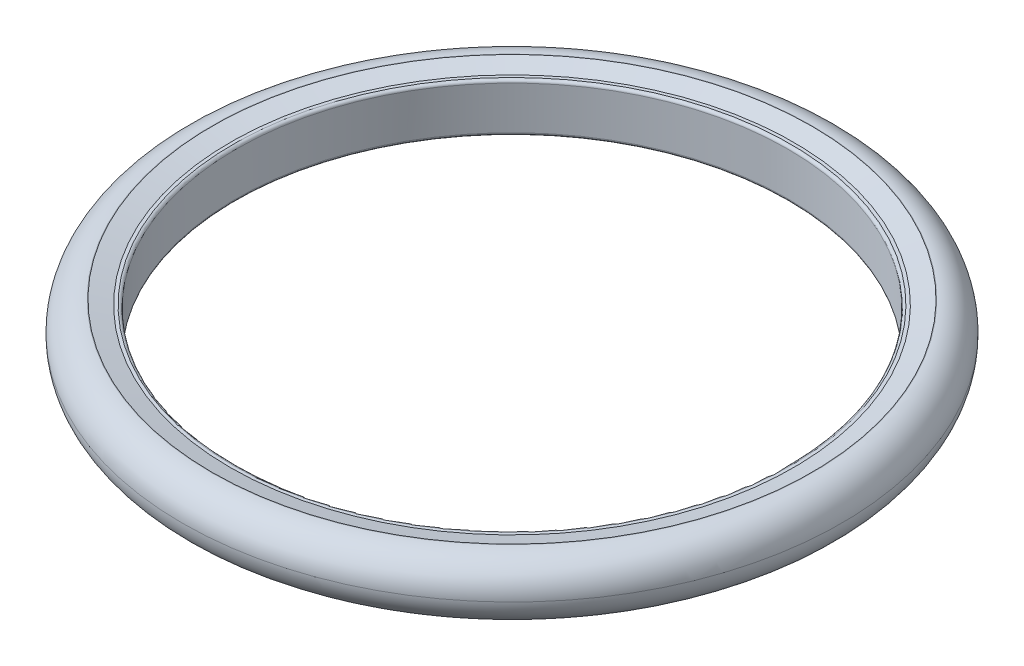
ISO-10303-21;
HEADER;
FILE_DESCRIPTION(('STEP AP214'),'2;1');
FILE_NAME('part.step','',(''),(''),'','','');
FILE_SCHEMA(('AUTOMOTIVE_DESIGN { 1 0 10303 214 1 1 1 1 }'));
ENDSEC;
DATA;
#1=APPLICATION_CONTEXT('core data for automotive mechanical design processes');
#2=APPLICATION_PROTOCOL_DEFINITION('international standard','automotive_design',2000,#1);
#3=PRODUCT_CONTEXT('',#1,'mechanical');
#4=PRODUCT('Part','Part','',(#3));
#5=PRODUCT_RELATED_PRODUCT_CATEGORY('part','',(#4));
#6=PRODUCT_DEFINITION_FORMATION('','',#4);
#7=PRODUCT_DEFINITION_CONTEXT('part definition',#1,'design');
#8=PRODUCT_DEFINITION('design','',#6,#7);
#9=PRODUCT_DEFINITION_SHAPE('','',#8);
#10=(LENGTH_UNIT() NAMED_UNIT(*) SI_UNIT(.MILLI.,.METRE.));
#11=(NAMED_UNIT(*) PLANE_ANGLE_UNIT() SI_UNIT($,.RADIAN.));
#12=(NAMED_UNIT(*) SI_UNIT($,.STERADIAN.) SOLID_ANGLE_UNIT());
#13=UNCERTAINTY_MEASURE_WITH_UNIT(LENGTH_MEASURE(1.E-05),#10,'distance_accuracy_value','');
#14=(GEOMETRIC_REPRESENTATION_CONTEXT(3) GLOBAL_UNCERTAINTY_ASSIGNED_CONTEXT((#13)) GLOBAL_UNIT_ASSIGNED_CONTEXT((#10,
#11,#12)) REPRESENTATION_CONTEXT('',''));
#15=CARTESIAN_POINT('',(0.,0.,0.));
#16=DIRECTION('',(0.,0.,1.));
#17=DIRECTION('',(1.,0.,0.));
#18=AXIS2_PLACEMENT_3D('',#15,#16,#17);
#19=CARTESIAN_POINT('',(0.,15.,0.));
#20=DIRECTION('',(0.,-1.,0.));
#21=DIRECTION('',(0.,0.,-1.));
#22=AXIS2_PLACEMENT_3D('',#19,#20,#21);
#23=CYLINDRICAL_SURFACE('',#22,170.);
#24=CARTESIAN_POINT('',(0.,13.25,0.));
#25=DIRECTION('',(0.,1.,0.));
#26=DIRECTION('',(0.,0.,1.));
#27=AXIS2_PLACEMENT_3D('',#24,#25,#26);
#28=CIRCLE('',#27,170.);
#29=CARTESIAN_POINT('',(0.,13.25,170.));
#30=VERTEX_POINT('',#29);
#31=EDGE_CURVE('E44',#30,#30,#28,.T.);
#32=ORIENTED_EDGE('',*,*,#31,.T.);
#33=EDGE_LOOP('',(#32));
#34=FACE_BOUND('',#33,.T.);
#35=CARTESIAN_POINT('',(0.,-13.25,0.));
#36=DIRECTION('',(0.,-1.,0.));
#37=DIRECTION('',(0.,0.,-1.));
#38=AXIS2_PLACEMENT_3D('',#35,#36,#37);
#39=CIRCLE('',#38,170.);
#40=CARTESIAN_POINT('',(0.,-13.25,-170.));
#41=VERTEX_POINT('',#40);
#42=EDGE_CURVE('E48',#41,#41,#39,.T.);
#43=ORIENTED_EDGE('',*,*,#42,.T.);
#44=EDGE_LOOP('',(#43));
#45=FACE_BOUND('',#44,.T.);
#46=ADVANCED_FACE('F33',(#34,#45),#23,.F.);
#47=CARTESIAN_POINT('',(0.,15.,0.));
#48=DIRECTION('',(0.,1.,0.));
#49=DIRECTION('',(0.,0.,1.));
#50=AXIS2_PLACEMENT_3D('',#47,#48,#49);
#51=PLANE('',#50);
#52=CARTESIAN_POINT('',(0.,15.,0.));
#53=DIRECTION('',(0.,1.,0.));
#54=DIRECTION('',(0.,0.,1.));
#55=AXIS2_PLACEMENT_3D('',#52,#53,#54);
#56=CIRCLE('',#55,171.75);
#57=CARTESIAN_POINT('',(0.,15.,171.75));
#58=VERTEX_POINT('',#57);
#59=EDGE_CURVE('E40',#58,#58,#56,.F.);
#60=ORIENTED_EDGE('',*,*,#59,.T.);
#61=EDGE_LOOP('',(#60));
#62=FACE_BOUND('',#61,.T.);
#63=CARTESIAN_POINT('',(0.,15.,0.));
#64=DIRECTION('',(0.,1.,0.));
#65=DIRECTION('',(0.,0.,1.));
#66=AXIS2_PLACEMENT_3D('',#63,#64,#65);
#67=CIRCLE('',#66,173.695873505534);
#68=CARTESIAN_POINT('',(0.,15.,173.695873505534));
#69=VERTEX_POINT('',#68);
#70=EDGE_CURVE('E69',#69,#69,#67,.T.);
#71=ORIENTED_EDGE('',*,*,#70,.T.);
#72=EDGE_LOOP('',(#71));
#73=FACE_BOUND('',#72,.T.);
#74=ADVANCED_FACE('F94',(#62,#73),#51,.T.);
#75=CARTESIAN_POINT('',(0.,18.,0.));
#76=DIRECTION('',(0.,1.,0.));
#77=DIRECTION('',(0.,0.,1.));
#78=AXIS2_PLACEMENT_3D('',#75,#76,#77);
#79=PLANE('',#78);
#80=CARTESIAN_POINT('',(0.,18.,0.));
#81=DIRECTION('',(0.,1.,0.));
#82=DIRECTION('',(0.,0.,1.));
#83=AXIS2_PLACEMENT_3D('',#80,#81,#82);
#84=CIRCLE('',#83,185.2);
#85=CARTESIAN_POINT('',(0.,18.,185.2));
#86=VERTEX_POINT('',#85);
#87=EDGE_CURVE('E60',#86,#86,#84,.T.);
#88=ORIENTED_EDGE('',*,*,#87,.T.);
#89=EDGE_LOOP('',(#88));
#90=FACE_BOUND('',#89,.T.);
#91=CARTESIAN_POINT('',(0.,18.,0.));
#92=DIRECTION('',(0.,1.,0.));
#93=DIRECTION('',(0.,0.,1.));
#94=AXIS2_PLACEMENT_3D('',#91,#92,#93);
#95=CIRCLE('',#94,184.89202592824);
#96=CARTESIAN_POINT('',(0.,18.,184.89202592824));
#97=VERTEX_POINT('',#96);
#98=EDGE_CURVE('E63',#97,#97,#95,.F.);
#99=ORIENTED_EDGE('',*,*,#98,.T.);
#100=EDGE_LOOP('',(#99));
#101=FACE_BOUND('',#100,.T.);
#102=ADVANCED_FACE('F91',(#90,#101),#79,.T.);
#103=CARTESIAN_POINT('',(0.,-15.,0.));
#104=DIRECTION('',(0.,-1.,0.));
#105=DIRECTION('',(0.,0.,1.));
#106=AXIS2_PLACEMENT_3D('',#103,#104,#105);
#107=PLANE('',#106);
#108=CARTESIAN_POINT('',(0.,-15.,0.));
#109=DIRECTION('',(0.,-1.,0.));
#110=DIRECTION('',(0.,0.,-1.));
#111=AXIS2_PLACEMENT_3D('',#108,#109,#110);
#112=CIRCLE('',#111,171.75);
#113=CARTESIAN_POINT('',(0.,-15.,-171.75));
#114=VERTEX_POINT('',#113);
#115=EDGE_CURVE('E10',#114,#114,#112,.F.);
#116=ORIENTED_EDGE('',*,*,#115,.T.);
#117=EDGE_LOOP('',(#116));
#118=FACE_BOUND('',#117,.T.);
#119=CARTESIAN_POINT('',(0.,-15.,0.));
#120=DIRECTION('',(0.,-1.,0.));
#121=DIRECTION('',(0.,0.,-1.));
#122=AXIS2_PLACEMENT_3D('',#119,#120,#121);
#123=CIRCLE('',#122,173.695873505534);
#124=CARTESIAN_POINT('',(0.,-15.,-173.695873505534));
#125=VERTEX_POINT('',#124);
#126=EDGE_CURVE('E57',#125,#125,#123,.T.);
#127=ORIENTED_EDGE('',*,*,#126,.T.);
#128=EDGE_LOOP('',(#127));
#129=FACE_BOUND('',#128,.T.);
#130=ADVANCED_FACE('F75',(#118,#129),#107,.T.);
#131=CARTESIAN_POINT('',(0.,-18.,0.));
#132=DIRECTION('',(0.,-1.,0.));
#133=DIRECTION('',(0.,0.,1.));
#134=AXIS2_PLACEMENT_3D('',#131,#132,#133);
#135=PLANE('',#134);
#136=CARTESIAN_POINT('',(0.,-18.,0.));
#137=DIRECTION('',(0.,-1.,0.));
#138=DIRECTION('',(0.,0.,-1.));
#139=AXIS2_PLACEMENT_3D('',#136,#137,#138);
#140=CIRCLE('',#139,185.2);
#141=CARTESIAN_POINT('',(0.,-18.,-185.2));
#142=VERTEX_POINT('',#141);
#143=EDGE_CURVE('E53',#142,#142,#140,.T.);
#144=ORIENTED_EDGE('',*,*,#143,.T.);
#145=EDGE_LOOP('',(#144));
#146=FACE_BOUND('',#145,.T.);
#147=CARTESIAN_POINT('',(0.,-18.,0.));
#148=DIRECTION('',(0.,-1.,0.));
#149=DIRECTION('',(0.,0.,-1.));
#150=AXIS2_PLACEMENT_3D('',#147,#148,#149);
#151=CIRCLE('',#150,184.89202592824);
#152=CARTESIAN_POINT('',(0.,-18.,-184.89202592824));
#153=VERTEX_POINT('',#152);
#154=EDGE_CURVE('E66',#153,#153,#151,.F.);
#155=ORIENTED_EDGE('',*,*,#154,.T.);
#156=EDGE_LOOP('',(#155));
#157=FACE_BOUND('',#156,.T.);
#158=ADVANCED_FACE('F81',(#146,#157),#135,.T.);
#159=CARTESIAN_POINT('',(0.,-19.019237886467,0.));
#160=DIRECTION('',(0.,-1.,0.));
#161=DIRECTION('',(0.,0.,-1.));
#162=AXIS2_PLACEMENT_3D('',#159,#160,#161);
#163=CONICAL_SURFACE('',#162,188.695873505534,1.30899693899574);
#164=ORIENTED_EDGE('',*,*,#126,.F.);
#165=EDGE_LOOP('',(#164));
#166=FACE_BOUND('',#165,.T.);
#167=ORIENTED_EDGE('',*,*,#154,.F.);
#168=EDGE_LOOP('',(#167));
#169=FACE_BOUND('',#168,.T.);
#170=ADVANCED_FACE('F77',(#166,#169),#163,.F.);
#171=CARTESIAN_POINT('',(0.,19.019237886467,0.));
#172=DIRECTION('',(0.,1.,0.));
#173=DIRECTION('',(0.,0.,1.));
#174=AXIS2_PLACEMENT_3D('',#171,#172,#173);
#175=CONICAL_SURFACE('',#174,188.695873505534,1.30899693899574);
#176=ORIENTED_EDGE('',*,*,#70,.F.);
#177=EDGE_LOOP('',(#176));
#178=FACE_BOUND('',#177,.T.);
#179=ORIENTED_EDGE('',*,*,#98,.F.);
#180=EDGE_LOOP('',(#179));
#181=FACE_BOUND('',#180,.T.);
#182=ADVANCED_FACE('F80',(#178,#181),#175,.F.);
#183=CARTESIAN_POINT('',(0.,0.,0.));
#184=DIRECTION('',(0.,-1.,0.));
#185=DIRECTION('',(0.,0.,-1.));
#186=AXIS2_PLACEMENT_3D('',#183,#184,#185);
#187=TOROIDAL_SURFACE('',#186,185.2,18.);
#188=ORIENTED_EDGE('',*,*,#143,.F.);
#189=EDGE_LOOP('',(#188));
#190=FACE_BOUND('',#189,.T.);
#191=CARTESIAN_POINT('',(0.,0.,0.));
#192=DIRECTION('',(0.,-1.,0.));
#193=DIRECTION('',(0.,0.,-1.));
#194=AXIS2_PLACEMENT_3D('',#191,#192,#193);
#195=CIRCLE('',#194,203.2);
#196=CARTESIAN_POINT('',(0.,0.,-203.2));
#197=VERTEX_POINT('',#196);
#198=EDGE_CURVE('E54',#197,#197,#195,.F.);
#199=ORIENTED_EDGE('',*,*,#198,.F.);
#200=EDGE_LOOP('',(#199));
#201=FACE_BOUND('',#200,.T.);
#202=ADVANCED_FACE('F106',(#190,#201),#187,.T.);
#203=CARTESIAN_POINT('',(0.,0.,0.));
#204=DIRECTION('',(0.,1.,0.));
#205=DIRECTION('',(0.,0.,1.));
#206=AXIS2_PLACEMENT_3D('',#203,#204,#205);
#207=TOROIDAL_SURFACE('',#206,185.2,18.);
#208=ORIENTED_EDGE('',*,*,#198,.T.);
#209=EDGE_LOOP('',(#208));
#210=FACE_BOUND('',#209,.T.);
#211=ORIENTED_EDGE('',*,*,#87,.F.);
#212=EDGE_LOOP('',(#211));
#213=FACE_BOUND('',#212,.T.);
#214=ADVANCED_FACE('F108',(#210,#213),#207,.T.);
#215=CARTESIAN_POINT('',(0.,13.25,0.));
#216=DIRECTION('',(0.,1.,0.));
#217=DIRECTION('',(0.,0.,1.));
#218=AXIS2_PLACEMENT_3D('',#215,#216,#217);
#219=TOROIDAL_SURFACE('',#218,171.75,1.75);
#220=ORIENTED_EDGE('',*,*,#59,.F.);
#221=EDGE_LOOP('',(#220));
#222=FACE_BOUND('',#221,.T.);
#223=ORIENTED_EDGE('',*,*,#31,.F.);
#224=EDGE_LOOP('',(#223));
#225=FACE_BOUND('',#224,.T.);
#226=ADVANCED_FACE('F111',(#222,#225),#219,.T.);
#227=CARTESIAN_POINT('',(0.,-13.25,0.));
#228=DIRECTION('',(0.,-1.,0.));
#229=DIRECTION('',(0.,0.,-1.));
#230=AXIS2_PLACEMENT_3D('',#227,#228,#229);
#231=TOROIDAL_SURFACE('',#230,171.75,1.75);
#232=ORIENTED_EDGE('',*,*,#42,.F.);
#233=EDGE_LOOP('',(#232));
#234=FACE_BOUND('',#233,.T.);
#235=ORIENTED_EDGE('',*,*,#115,.F.);
#236=EDGE_LOOP('',(#235));
#237=FACE_BOUND('',#236,.T.);
#238=ADVANCED_FACE('F35',(#234,#237),#231,.T.);
#239=CLOSED_SHELL('',(#46,#74,#102,#130,#158,#170,#182,#202,#214,#226,#238));
#240=MANIFOLD_SOLID_BREP('B2',#239);
#241=ADVANCED_BREP_SHAPE_REPRESENTATION('',(#18,#240),#14);
#242=SHAPE_DEFINITION_REPRESENTATION(#9,#241);
ENDSEC;
END-ISO-10303-21;
